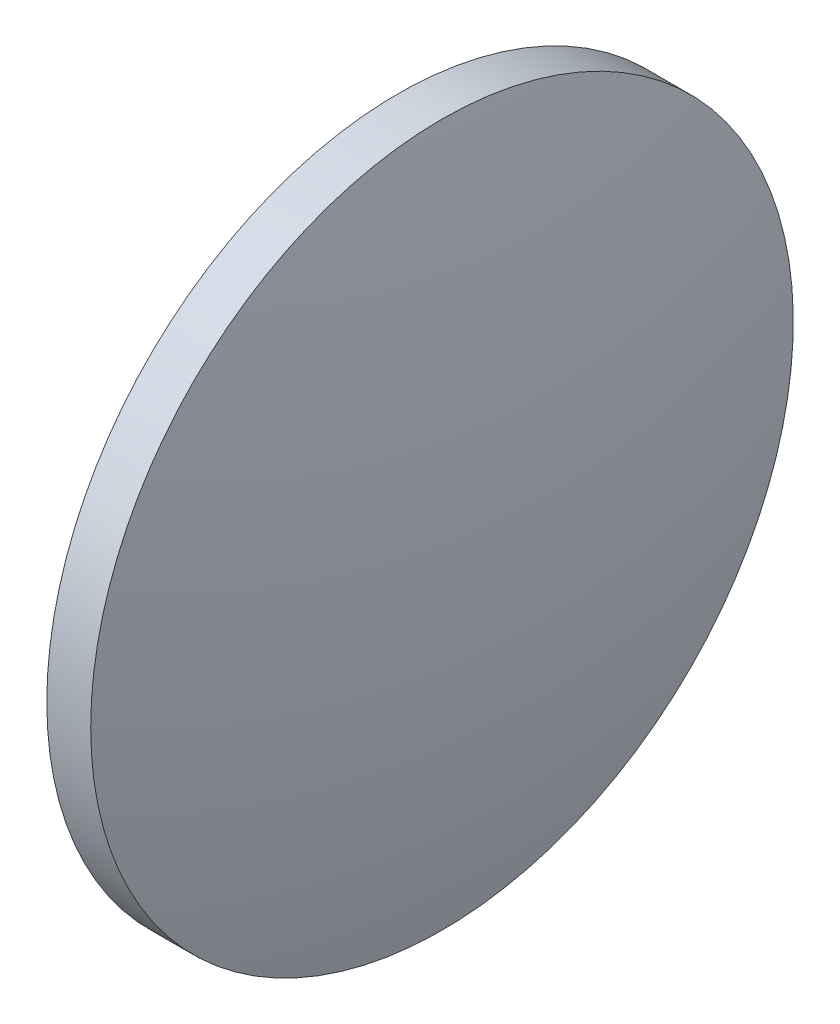
ISO-10303-21;
HEADER;
FILE_DESCRIPTION(('STEP AP214'),'2;1');
FILE_NAME('part.step','',(''),(''),'','','');
FILE_SCHEMA(('AUTOMOTIVE_DESIGN { 1 0 10303 214 1 1 1 1 }'));
ENDSEC;
DATA;
#1=APPLICATION_CONTEXT('core data for automotive mechanical design processes');
#2=APPLICATION_PROTOCOL_DEFINITION('international standard','automotive_design',2000,#1);
#3=PRODUCT_CONTEXT('',#1,'mechanical');
#4=PRODUCT('Part','Part','',(#3));
#5=PRODUCT_RELATED_PRODUCT_CATEGORY('part','',(#4));
#6=PRODUCT_DEFINITION_FORMATION('','',#4);
#7=PRODUCT_DEFINITION_CONTEXT('part definition',#1,'design');
#8=PRODUCT_DEFINITION('design','',#6,#7);
#9=PRODUCT_DEFINITION_SHAPE('','',#8);
#10=(LENGTH_UNIT() NAMED_UNIT(*) SI_UNIT(.MILLI.,.METRE.));
#11=(NAMED_UNIT(*) PLANE_ANGLE_UNIT() SI_UNIT($,.RADIAN.));
#12=(NAMED_UNIT(*) SI_UNIT($,.STERADIAN.) SOLID_ANGLE_UNIT());
#13=UNCERTAINTY_MEASURE_WITH_UNIT(LENGTH_MEASURE(1.E-05),#10,'distance_accuracy_value','');
#14=(GEOMETRIC_REPRESENTATION_CONTEXT(3) GLOBAL_UNCERTAINTY_ASSIGNED_CONTEXT((#13)) GLOBAL_UNIT_ASSIGNED_CONTEXT((#10,
#11,#12)) REPRESENTATION_CONTEXT('',''));
#15=CARTESIAN_POINT('',(0.,0.,0.));
#16=DIRECTION('',(0.,0.,1.));
#17=DIRECTION('',(1.,0.,0.));
#18=AXIS2_PLACEMENT_3D('',#15,#16,#17);
#19=CARTESIAN_POINT('',(571.373947978963,6.34597949632313,0.));
#20=DIRECTION('',(-1.,0.,0.));
#21=DIRECTION('',(0.,1.,0.));
#22=AXIS2_PLACEMENT_3D('',#19,#20,#21);
#23=SPHERICAL_SURFACE('',#22,82.5308130081303);
#24=CARTESIAN_POINT('',(651.444760987093,6.34597949632314,0.));
#25=DIRECTION('',(-1.,0.,0.));
#26=DIRECTION('',(0.,0.,1.));
#27=AXIS2_PLACEMENT_3D('',#24,#25,#26);
#28=CIRCLE('',#27,20.);
#29=CARTESIAN_POINT('',(651.444760987093,6.34597949632314,20.));
#30=VERTEX_POINT('',#29);
#31=EDGE_CURVE('E10',#30,#30,#28,.T.);
#32=ORIENTED_EDGE('',*,*,#31,.F.);
#33=EDGE_LOOP('',(#32));
#34=FACE_BOUND('',#33,.T.);
#35=ADVANCED_FACE('F35',(#34),#23,.T.);
#36=CARTESIAN_POINT('',(644.250217806516,6.34597949632314,0.));
#37=DIRECTION('',(-1.,0.,0.));
#38=DIRECTION('',(0.,0.,1.));
#39=AXIS2_PLACEMENT_3D('',#36,#37,#38);
#40=CYLINDRICAL_SURFACE('',#39,20.);
#41=CARTESIAN_POINT('',(648.944760987093,6.34597949632314,0.));
#42=DIRECTION('',(-1.,0.,0.));
#43=DIRECTION('',(0.,0.,1.));
#44=AXIS2_PLACEMENT_3D('',#41,#42,#43);
#45=CIRCLE('',#44,20.);
#46=CARTESIAN_POINT('',(648.944760987093,6.34597949632314,20.));
#47=VERTEX_POINT('',#46);
#48=EDGE_CURVE('E41',#47,#47,#45,.T.);
#49=ORIENTED_EDGE('',*,*,#48,.F.);
#50=EDGE_LOOP('',(#49));
#51=FACE_BOUND('',#50,.T.);
#52=ORIENTED_EDGE('',*,*,#31,.T.);
#53=EDGE_LOOP('',(#52));
#54=FACE_BOUND('',#53,.T.);
#55=ADVANCED_FACE('F49',(#51,#54),#40,.T.);
#56=CARTESIAN_POINT('',(648.944760987093,6.34597949632314,0.));
#57=DIRECTION('',(1.,0.,0.));
#58=DIRECTION('',(0.,0.,-1.));
#59=AXIS2_PLACEMENT_3D('',#56,#57,#58);
#60=PLANE('',#59);
#61=ORIENTED_EDGE('',*,*,#48,.T.);
#62=EDGE_LOOP('',(#61));
#63=FACE_BOUND('',#62,.T.);
#64=ADVANCED_FACE('F47',(#63),#60,.F.);
#65=CLOSED_SHELL('',(#35,#55,#64));
#66=MANIFOLD_SOLID_BREP('B2',#65);
#67=ADVANCED_BREP_SHAPE_REPRESENTATION('',(#18,#66),#14);
#68=SHAPE_DEFINITION_REPRESENTATION(#9,#67);
ENDSEC;
END-ISO-10303-21;
